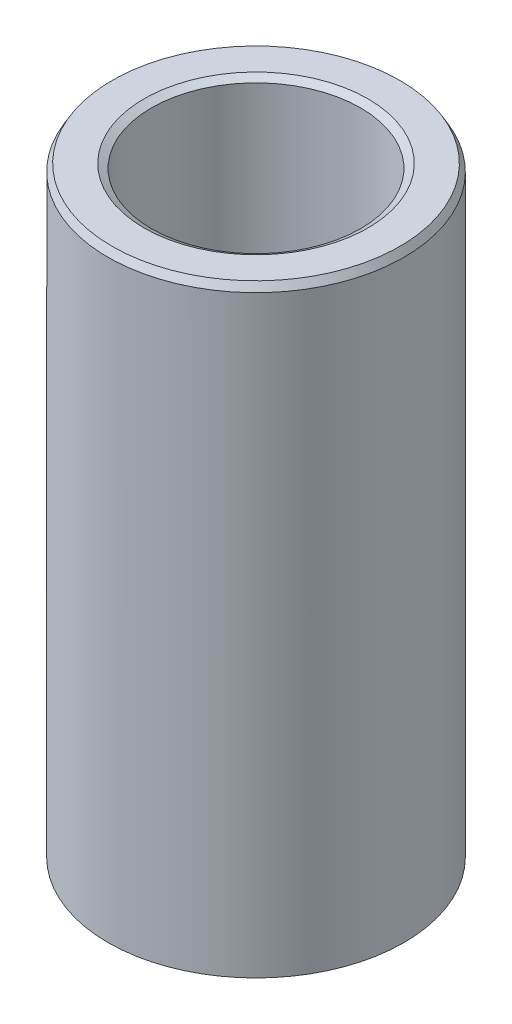
ISO-10303-21;
HEADER;
FILE_DESCRIPTION(('STEP AP214'),'2;1');
FILE_NAME('part.step','',(''),(''),'','','');
FILE_SCHEMA(('AUTOMOTIVE_DESIGN { 1 0 10303 214 1 1 1 1 }'));
ENDSEC;
DATA;
#1=APPLICATION_CONTEXT('core data for automotive mechanical design processes');
#2=APPLICATION_PROTOCOL_DEFINITION('international standard','automotive_design',2000,#1);
#3=PRODUCT_CONTEXT('',#1,'mechanical');
#4=PRODUCT('Part','Part','',(#3));
#5=PRODUCT_RELATED_PRODUCT_CATEGORY('part','',(#4));
#6=PRODUCT_DEFINITION_FORMATION('','',#4);
#7=PRODUCT_DEFINITION_CONTEXT('part definition',#1,'design');
#8=PRODUCT_DEFINITION('design','',#6,#7);
#9=PRODUCT_DEFINITION_SHAPE('','',#8);
#10=(LENGTH_UNIT() NAMED_UNIT(*) SI_UNIT(.MILLI.,.METRE.));
#11=(NAMED_UNIT(*) PLANE_ANGLE_UNIT() SI_UNIT($,.RADIAN.));
#12=(NAMED_UNIT(*) SI_UNIT($,.STERADIAN.) SOLID_ANGLE_UNIT());
#13=UNCERTAINTY_MEASURE_WITH_UNIT(LENGTH_MEASURE(1.E-05),#10,'distance_accuracy_value','');
#14=(GEOMETRIC_REPRESENTATION_CONTEXT(3) GLOBAL_UNCERTAINTY_ASSIGNED_CONTEXT((#13)) GLOBAL_UNIT_ASSIGNED_CONTEXT((#10,
#11,#12)) REPRESENTATION_CONTEXT('',''));
#15=CARTESIAN_POINT('',(0.,0.,0.));
#16=DIRECTION('',(0.,0.,1.));
#17=DIRECTION('',(1.,0.,0.));
#18=AXIS2_PLACEMENT_3D('',#15,#16,#17);
#19=CARTESIAN_POINT('',(0.,235.009031367991,0.));
#20=DIRECTION('',(0.,-1.,0.));
#21=DIRECTION('',(0.,0.,-1.));
#22=AXIS2_PLACEMENT_3D('',#19,#20,#21);
#23=CYLINDRICAL_SURFACE('',#22,57.5);
#24=CARTESIAN_POINT('',(0.,1.63872268421589,0.));
#25=DIRECTION('',(0.,1.,0.));
#26=DIRECTION('',(0.,0.,1.));
#27=AXIS2_PLACEMENT_3D('',#24,#25,#26);
#28=CIRCLE('',#27,57.5);
#29=CARTESIAN_POINT('',(0.,1.63872268421586,-57.5));
#30=VERTEX_POINT('',#29);
#31=EDGE_CURVE('E10',#30,#30,#28,.T.);
#32=CARTESIAN_POINT('',(0.,232.170680419414,0.));
#33=DIRECTION('',(0.,1.,0.));
#34=DIRECTION('',(0.,0.,1.));
#35=AXIS2_PLACEMENT_3D('',#32,#33,#34);
#36=CIRCLE('',#35,57.5);
#37=CARTESIAN_POINT('',(0.,232.170680419414,-57.5));
#38=VERTEX_POINT('',#37);
#39=EDGE_CURVE('E50',#38,#38,#36,.F.);
#40=CARTESIAN_POINT('',(0.,1.63872268421586,-57.5));
#41=CARTESIAN_POINT('',(0.,4.04009724395751,-57.5));
#42=CARTESIAN_POINT('',(0.,6.44147180369915,-57.5));
#43=CARTESIAN_POINT('',(0.,11.2442209231824,-57.5));
#44=CARTESIAN_POINT('',(0.,13.6455954829241,-57.5));
#45=CARTESIAN_POINT('',(0.,18.4483446024074,-57.5));
#46=CARTESIAN_POINT('',(0.,20.849719162149,-57.5));
#47=CARTESIAN_POINT('',(0.,25.6524682816323,-57.5));
#48=CARTESIAN_POINT('',(0.,28.053842841374,-57.5));
#49=CARTESIAN_POINT('',(0.,32.8565919608573,-57.5));
#50=CARTESIAN_POINT('',(0.,35.2579665205989,-57.5));
#51=CARTESIAN_POINT('',(0.,40.0607156400822,-57.5));
#52=CARTESIAN_POINT('',(0.,42.4620901998238,-57.5));
#53=CARTESIAN_POINT('',(0.,47.2648393193071,-57.5));
#54=CARTESIAN_POINT('',(0.,49.6662138790488,-57.5));
#55=CARTESIAN_POINT('',(0.,54.4689629985321,-57.5));
#56=CARTESIAN_POINT('',(0.,56.8703375582737,-57.5));
#57=CARTESIAN_POINT('',(0.,61.673086677757,-57.5));
#58=CARTESIAN_POINT('',(0.,64.0744612374987,-57.5));
#59=CARTESIAN_POINT('',(0.,68.8772103569819,-57.5));
#60=CARTESIAN_POINT('',(0.,71.2785849167236,-57.5));
#61=CARTESIAN_POINT('',(0.,76.0813340362069,-57.5));
#62=CARTESIAN_POINT('',(0.,78.4827085959486,-57.5));
#63=CARTESIAN_POINT('',(0.,83.2854577154318,-57.5));
#64=CARTESIAN_POINT('',(0.,85.6868322751735,-57.5));
#65=CARTESIAN_POINT('',(0.,90.4895813946568,-57.5));
#66=CARTESIAN_POINT('',(0.,92.8909559543984,-57.5));
#67=CARTESIAN_POINT('',(0.,97.6937050738817,-57.5));
#68=CARTESIAN_POINT('',(0.,100.095079633623,-57.5));
#69=CARTESIAN_POINT('',(0.,104.897828753107,-57.5));
#70=CARTESIAN_POINT('',(0.,107.299203312848,-57.5));
#71=CARTESIAN_POINT('',(0.,112.101952432332,-57.5));
#72=CARTESIAN_POINT('',(0.,114.503326992073,-57.5));
#73=CARTESIAN_POINT('',(0.,119.306076111557,-57.5));
#74=CARTESIAN_POINT('',(0.,121.707450671298,-57.5));
#75=CARTESIAN_POINT('',(0.,126.510199790781,-57.5));
#76=CARTESIAN_POINT('',(0.,128.911574350523,-57.5));
#77=CARTESIAN_POINT('',(0.,133.714323470006,-57.5));
#78=CARTESIAN_POINT('',(0.,136.115698029748,-57.5));
#79=CARTESIAN_POINT('',(0.,140.918447149231,-57.5));
#80=CARTESIAN_POINT('',(0.,143.319821708973,-57.5));
#81=CARTESIAN_POINT('',(0.,148.122570828456,-57.5));
#82=CARTESIAN_POINT('',(0.,150.523945388198,-57.5));
#83=CARTESIAN_POINT('',(0.,155.326694507681,-57.5));
#84=CARTESIAN_POINT('',(0.,157.728069067423,-57.5));
#85=CARTESIAN_POINT('',(0.,162.530818186906,-57.5));
#86=CARTESIAN_POINT('',(0.,164.932192746648,-57.5));
#87=CARTESIAN_POINT('',(0.,169.734941866131,-57.5));
#88=CARTESIAN_POINT('',(0.,172.136316425873,-57.5));
#89=CARTESIAN_POINT('',(0.,176.939065545356,-57.5));
#90=CARTESIAN_POINT('',(0.,179.340440105098,-57.5));
#91=CARTESIAN_POINT('',(0.,184.143189224581,-57.5));
#92=CARTESIAN_POINT('',(0.,186.544563784323,-57.5));
#93=CARTESIAN_POINT('',(0.,191.347312903806,-57.5));
#94=CARTESIAN_POINT('',(0.,193.748687463548,-57.5));
#95=CARTESIAN_POINT('',(0.,198.551436583031,-57.5));
#96=CARTESIAN_POINT('',(0.,200.952811142772,-57.5));
#97=CARTESIAN_POINT('',(0.,205.755560262256,-57.5));
#98=CARTESIAN_POINT('',(0.,208.156934821997,-57.5));
#99=CARTESIAN_POINT('',(0.,212.959683941481,-57.5));
#100=CARTESIAN_POINT('',(0.,215.361058501222,-57.5));
#101=CARTESIAN_POINT('',(0.,220.163807620706,-57.5));
#102=CARTESIAN_POINT('',(0.,222.565182180447,-57.5));
#103=CARTESIAN_POINT('',(0.,227.367931299931,-57.5));
#104=CARTESIAN_POINT('',(0.,229.769305859672,-57.5));
#105=CARTESIAN_POINT('',(0.,232.170680419414,-57.5));
#106=B_SPLINE_CURVE_WITH_KNOTS('',3,(#40,#41,#42,#43,#44,#45,#46,#47,#48,#49,#50,#51,#52,#53,
#54,#55,#56,#57,#58,#59,#60,#61,#62,#63,#64,#65,#66,#67,#68,#69,#70,#71,#72,#73,#74,#75,#76,#77,
#78,#79,#80,#81,#82,#83,#84,#85,#86,#87,#88,#89,#90,#91,#92,#93,#94,#95,#96,#97,#98,#99,#100,
#101,#102,#103,#104,#105),.UNSPECIFIED.,.F.,.F.,(4,2,2,2,2,2,2,2,2,2,2,2,2,2,2,2,2,2,2,2,2,2,2,
2,2,2,2,2,2,2,2,2,4),(0.,7.20412367922493,14.4082473584499,21.6123710376748,28.8164947168998,
36.0206183961247,43.2247420753496,50.4288657545746,57.6329894337995,64.8371131130245,
72.0412367922494,79.2453604714743,86.4494841506992,93.6536078299242,100.857731509149,
108.061855188374,115.265978867599,122.470102546824,129.674226226049,136.878349905274,
144.082473584499,151.286597263724,158.490720942949,165.694844622174,172.898968301398,
180.103091980623,187.307215659848,194.511339339073,201.715463018298,208.919586697523,
216.123710376748,223.327834055973,230.531957735198),.UNSPECIFIED.);
#107=EDGE_CURVE('BSEAM39',#30,#38,#106,.T.);
#108=ORIENTED_EDGE('',*,*,#31,.T.);
#109=ORIENTED_EDGE('',*,*,#39,.T.);
#110=ORIENTED_EDGE('',*,*,#107,.T.);
#111=ORIENTED_EDGE('',*,*,#107,.F.);
#112=EDGE_LOOP('',(#108,#110,#109,#111));
#113=FACE_BOUND('',#112,.T.);
#114=ADVANCED_FACE('F39',(#113),#23,.T.);
#115=CARTESIAN_POINT('',(0.,235.009031367991,0.));
#116=DIRECTION('',(0.,1.,0.));
#117=DIRECTION('',(0.,0.,1.));
#118=AXIS2_PLACEMENT_3D('',#115,#116,#117);
#119=PLANE('',#118);
#120=CARTESIAN_POINT('',(0.,235.009031367991,0.));
#121=DIRECTION('',(0.,1.,0.));
#122=DIRECTION('',(0.,0.,1.));
#123=AXIS2_PLACEMENT_3D('',#120,#121,#122);
#124=CIRCLE('',#123,43.4793904376041);
#125=CARTESIAN_POINT('',(0.,235.009031367991,43.4793904376041));
#126=VERTEX_POINT('',#125);
#127=EDGE_CURVE('E58',#126,#126,#124,.F.);
#128=ORIENTED_EDGE('',*,*,#127,.T.);
#129=EDGE_LOOP('',(#128));
#130=FACE_BOUND('',#129,.T.);
#131=CARTESIAN_POINT('',(0.,235.009031367991,0.));
#132=DIRECTION('',(0.,1.,0.));
#133=DIRECTION('',(0.,0.,1.));
#134=AXIS2_PLACEMENT_3D('',#131,#132,#133);
#135=CIRCLE('',#134,55.8612773157843);
#136=CARTESIAN_POINT('',(0.,235.009031367991,55.8612773157843));
#137=VERTEX_POINT('',#136);
#138=EDGE_CURVE('E61',#137,#137,#135,.T.);
#139=ORIENTED_EDGE('',*,*,#138,.T.);
#140=EDGE_LOOP('',(#139));
#141=FACE_BOUND('',#140,.T.);
#142=ADVANCED_FACE('F88',(#130,#141),#119,.T.);
#143=CARTESIAN_POINT('',(0.,0.,0.));
#144=DIRECTION('',(0.,1.,0.));
#145=DIRECTION('',(0.,0.,1.));
#146=AXIS2_PLACEMENT_3D('',#143,#144,#145);
#147=PLANE('',#146);
#148=CARTESIAN_POINT('',(0.,0.,0.));
#149=DIRECTION('',(0.,1.,0.));
#150=DIRECTION('',(0.,0.,1.));
#151=AXIS2_PLACEMENT_3D('',#148,#149,#150);
#152=CIRCLE('',#151,42.2797621732423);
#153=CARTESIAN_POINT('',(0.,0.,-42.2797621732423));
#154=VERTEX_POINT('',#153);
#155=EDGE_CURVE('E51',#154,#154,#152,.T.);
#156=ORIENTED_EDGE('',*,*,#155,.T.);
#157=EDGE_LOOP('',(#156));
#158=FACE_BOUND('',#157,.T.);
#159=CARTESIAN_POINT('',(0.,0.,0.));
#160=DIRECTION('',(0.,1.,0.));
#161=DIRECTION('',(0.,0.,1.));
#162=AXIS2_PLACEMENT_3D('',#159,#160,#161);
#163=CIRCLE('',#162,54.6616490514224);
#164=CARTESIAN_POINT('',(0.,0.,54.6616490514224));
#165=VERTEX_POINT('',#164);
#166=EDGE_CURVE('E54',#165,#165,#163,.F.);
#167=ORIENTED_EDGE('',*,*,#166,.T.);
#168=EDGE_LOOP('',(#167));
#169=FACE_BOUND('',#168,.T.);
#170=ADVANCED_FACE('F83',(#158,#169),#147,.F.);
#171=CARTESIAN_POINT('',(0.,235.009031367991,0.));
#172=DIRECTION('',(0.,-1.,0.));
#173=DIRECTION('',(0.,0.,-1.));
#174=AXIS2_PLACEMENT_3D('',#171,#172,#173);
#175=CYLINDRICAL_SURFACE('',#174,40.6410394890264);
#176=CARTESIAN_POINT('',(0.,233.370308683775,0.));
#177=DIRECTION('',(0.,1.,0.));
#178=DIRECTION('',(0.,0.,1.));
#179=AXIS2_PLACEMENT_3D('',#176,#177,#178);
#180=CIRCLE('',#179,40.6410394890264);
#181=CARTESIAN_POINT('',(0.,233.370308683775,-40.6410394890264));
#182=VERTEX_POINT('',#181);
#183=EDGE_CURVE('E67',#182,#182,#180,.T.);
#184=CARTESIAN_POINT('',(0.,2.83835094857754,0.));
#185=DIRECTION('',(0.,1.,0.));
#186=DIRECTION('',(0.,0.,1.));
#187=AXIS2_PLACEMENT_3D('',#184,#185,#186);
#188=CIRCLE('',#187,40.6410394890264);
#189=CARTESIAN_POINT('',(0.,2.83835094857751,-40.6410394890264));
#190=VERTEX_POINT('',#189);
#191=EDGE_CURVE('E69',#190,#190,#188,.F.);
#192=CARTESIAN_POINT('',(0.,233.370308683775,-40.6410394890264));
#193=CARTESIAN_POINT('',(0.,230.968934124033,-40.6410394890264));
#194=CARTESIAN_POINT('',(0.,228.567559564292,-40.6410394890264));
#195=CARTESIAN_POINT('',(0.,223.764810444809,-40.6410394890264));
#196=CARTESIAN_POINT('',(0.,221.363435885067,-40.6410394890264));
#197=CARTESIAN_POINT('',(0.,216.560686765584,-40.6410394890264));
#198=CARTESIAN_POINT('',(0.,214.159312205842,-40.6410394890264));
#199=CARTESIAN_POINT('',(0.,209.356563086359,-40.6410394890264));
#200=CARTESIAN_POINT('',(0.,206.955188526617,-40.6410394890264));
#201=CARTESIAN_POINT('',(0.,202.152439407134,-40.6410394890264));
#202=CARTESIAN_POINT('',(0.,199.751064847392,-40.6410394890264));
#203=CARTESIAN_POINT('',(0.,194.948315727909,-40.6410394890264));
#204=CARTESIAN_POINT('',(0.,192.546941168167,-40.6410394890264));
#205=CARTESIAN_POINT('',(0.,187.744192048684,-40.6410394890264));
#206=CARTESIAN_POINT('',(0.,185.342817488942,-40.6410394890264));
#207=CARTESIAN_POINT('',(0.,180.540068369459,-40.6410394890264));
#208=CARTESIAN_POINT('',(0.,178.138693809717,-40.6410394890264));
#209=CARTESIAN_POINT('',(0.,173.335944690234,-40.6410394890264));
#210=CARTESIAN_POINT('',(0.,170.934570130492,-40.6410394890264));
#211=CARTESIAN_POINT('',(0.,166.131821011009,-40.6410394890264));
#212=CARTESIAN_POINT('',(0.,163.730446451268,-40.6410394890264));
#213=CARTESIAN_POINT('',(0.,158.927697331784,-40.6410394890264));
#214=CARTESIAN_POINT('',(0.,156.526322772043,-40.6410394890264));
#215=CARTESIAN_POINT('',(0.,151.723573652559,-40.6410394890264));
#216=CARTESIAN_POINT('',(0.,149.322199092818,-40.6410394890264));
#217=CARTESIAN_POINT('',(0.,144.519449973334,-40.6410394890264));
#218=CARTESIAN_POINT('',(0.,142.118075413593,-40.6410394890264));
#219=CARTESIAN_POINT('',(0.,137.315326294109,-40.6410394890264));
#220=CARTESIAN_POINT('',(0.,134.913951734368,-40.6410394890264));
#221=CARTESIAN_POINT('',(0.,130.111202614885,-40.6410394890264));
#222=CARTESIAN_POINT('',(0.,127.709828055143,-40.6410394890264));
#223=CARTESIAN_POINT('',(0.,122.90707893566,-40.6410394890264));
#224=CARTESIAN_POINT('',(0.,120.505704375918,-40.6410394890264));
#225=CARTESIAN_POINT('',(0.,115.702955256435,-40.6410394890264));
#226=CARTESIAN_POINT('',(0.,113.301580696693,-40.6410394890264));
#227=CARTESIAN_POINT('',(0.,108.49883157721,-40.6410394890264));
#228=CARTESIAN_POINT('',(0.,106.097457017468,-40.6410394890264));
#229=CARTESIAN_POINT('',(0.,101.294707897985,-40.6410394890264));
#230=CARTESIAN_POINT('',(0.,98.8933333382432,-40.6410394890264));
#231=CARTESIAN_POINT('',(0.,94.0905842187599,-40.6410394890264));
#232=CARTESIAN_POINT('',(0.,91.6892096590183,-40.6410394890264));
#233=CARTESIAN_POINT('',(0.,86.886460539535,-40.6410394890264));
#234=CARTESIAN_POINT('',(0.,84.4850859797933,-40.6410394890264));
#235=CARTESIAN_POINT('',(0.,79.68233686031,-40.6410394890264));
#236=CARTESIAN_POINT('',(0.,77.2809623005684,-40.6410394890264));
#237=CARTESIAN_POINT('',(0.,72.4782131810851,-40.6410394890264));
#238=CARTESIAN_POINT('',(0.,70.0768386213435,-40.6410394890264));
#239=CARTESIAN_POINT('',(0.,65.2740895018602,-40.6410394890264));
#240=CARTESIAN_POINT('',(0.,62.8727149421186,-40.6410394890264));
#241=CARTESIAN_POINT('',(0.,58.0699658226353,-40.6410394890264));
#242=CARTESIAN_POINT('',(0.,55.6685912628936,-40.6410394890264));
#243=CARTESIAN_POINT('',(0.,50.8658421434103,-40.6410394890264));
#244=CARTESIAN_POINT('',(0.,48.4644675836687,-40.6410394890264));
#245=CARTESIAN_POINT('',(0.,43.6617184641854,-40.6410394890264));
#246=CARTESIAN_POINT('',(0.,41.2603439044438,-40.6410394890264));
#247=CARTESIAN_POINT('',(0.,36.4575947849605,-40.6410394890264));
#248=CARTESIAN_POINT('',(0.,34.0562202252189,-40.6410394890264));
#249=CARTESIAN_POINT('',(0.,29.2534711057356,-40.6410394890264));
#250=CARTESIAN_POINT('',(0.,26.8520965459939,-40.6410394890264));
#251=CARTESIAN_POINT('',(0.,22.0493474265106,-40.6410394890264));
#252=CARTESIAN_POINT('',(0.,19.647972866769,-40.6410394890264));
#253=CARTESIAN_POINT('',(0.,14.8452237472857,-40.6410394890264));
#254=CARTESIAN_POINT('',(0.,12.4438491875441,-40.6410394890264));
#255=CARTESIAN_POINT('',(0.,7.6411000680608,-40.6410394890264));
#256=CARTESIAN_POINT('',(0.,5.23972550831916,-40.6410394890264));
#257=CARTESIAN_POINT('',(0.,2.83835094857751,-40.6410394890264));
#258=B_SPLINE_CURVE_WITH_KNOTS('',3,(#192,#193,#194,#195,#196,#197,#198,#199,#200,#201,#202,
#203,#204,#205,#206,#207,#208,#209,#210,#211,#212,#213,#214,#215,#216,#217,#218,#219,#220,#221,
#222,#223,#224,#225,#226,#227,#228,#229,#230,#231,#232,#233,#234,#235,#236,#237,#238,#239,#240,
#241,#242,#243,#244,#245,#246,#247,#248,#249,#250,#251,#252,#253,#254,#255,#256,#257),
.UNSPECIFIED.,.F.,.F.,(4,2,2,2,2,2,2,2,2,2,2,2,2,2,2,2,2,2,2,2,2,2,2,2,2,2,2,2,2,2,2,2,4),(0.,
7.2041236792249,14.4082473584498,21.6123710376747,28.8164947168997,36.0206183961246,
43.2247420753495,50.4288657545744,57.6329894337994,64.8371131130243,72.0412367922492,
79.2453604714742,86.4494841506991,93.653607829924,100.857731509149,108.061855188374,
115.265978867599,122.470102546824,129.674226226049,136.878349905274,144.082473584498,
151.286597263723,158.490720942948,165.694844622173,172.898968301398,180.103091980623,
187.307215659848,194.511339339073,201.715463018298,208.919586697523,216.123710376748,
223.327834055973,230.531957735198),.UNSPECIFIED.);
#259=EDGE_CURVE('BSEAM71',#182,#190,#258,.T.);
#260=ORIENTED_EDGE('',*,*,#183,.T.);
#261=ORIENTED_EDGE('',*,*,#191,.T.);
#262=ORIENTED_EDGE('',*,*,#259,.T.);
#263=ORIENTED_EDGE('',*,*,#259,.F.);
#264=EDGE_LOOP('',(#260,#262,#261,#263));
#265=FACE_BOUND('',#264,.T.);
#266=ADVANCED_FACE('F71',(#265),#175,.F.);
#267=CARTESIAN_POINT('',(0.,233.370308683775,0.));
#268=DIRECTION('',(0.,1.,0.));
#269=DIRECTION('',(0.,0.,1.));
#270=AXIS2_PLACEMENT_3D('',#267,#268,#269);
#271=CONICAL_SURFACE('',#270,40.6410394890264,1.0471975511966);
#272=ORIENTED_EDGE('',*,*,#127,.F.);
#273=EDGE_LOOP('',(#272));
#274=FACE_BOUND('',#273,.T.);
#275=ORIENTED_EDGE('',*,*,#183,.F.);
#276=EDGE_LOOP('',(#275));
#277=FACE_BOUND('',#276,.T.);
#278=ADVANCED_FACE('F77',(#274,#277),#271,.F.);
#279=CARTESIAN_POINT('',(0.,0.,0.));
#280=DIRECTION('',(0.,-1.,0.));
#281=DIRECTION('',(0.,0.,-1.));
#282=AXIS2_PLACEMENT_3D('',#279,#280,#281);
#283=CONICAL_SURFACE('',#282,42.2797621732423,0.52359877559829);
#284=CARTESIAN_POINT('',(0.,2.83835094857754,-40.6410394890264));
#285=CARTESIAN_POINT('',(0.,2.80878479286319,-40.658109516987));
#286=CARTESIAN_POINT('',(0.,2.77921863714884,-40.6751795449476));
#287=CARTESIAN_POINT('',(0.,2.72008632572014,-40.7093196008688));
#288=CARTESIAN_POINT('',(0.,2.69052017000579,-40.7263896288293));
#289=CARTESIAN_POINT('',(0.,2.63138785857709,-40.7605296847505));
#290=CARTESIAN_POINT('',(0.,2.60182170286274,-40.7775997127111));
#291=CARTESIAN_POINT('',(0.,2.54268939143405,-40.8117397686323));
#292=CARTESIAN_POINT('',(0.,2.5131232357197,-40.8288097965928));
#293=CARTESIAN_POINT('',(0.,2.453990924291,-40.862949852514));
#294=CARTESIAN_POINT('',(0.,2.42442476857665,-40.8800198804746));
#295=CARTESIAN_POINT('',(0.,2.36529245714795,-40.9141599363957));
#296=CARTESIAN_POINT('',(0.,2.3357263014336,-40.9312299643563));
#297=CARTESIAN_POINT('',(0.,2.2765939900049,-40.9653700202775));
#298=CARTESIAN_POINT('',(0.,2.24702783429055,-40.9824400482381));
#299=CARTESIAN_POINT('',(0.,2.18789552286185,-41.0165801041592));
#300=CARTESIAN_POINT('',(0.,2.1583293671475,-41.0336501321198));
#301=CARTESIAN_POINT('',(0.,2.0991970557188,-41.067790188041));
#302=CARTESIAN_POINT('',(0.,2.06963090000446,-41.0848602160016));
#303=CARTESIAN_POINT('',(0.,2.01049858857576,-41.1190002719227));
#304=CARTESIAN_POINT('',(0.,1.98093243286141,-41.1360702998833));
#305=CARTESIAN_POINT('',(0.,1.92180012143271,-41.1702103558045));
#306=CARTESIAN_POINT('',(0.,1.89223396571836,-41.187280383765));
#307=CARTESIAN_POINT('',(0.,1.83310165428966,-41.2214204396862));
#308=CARTESIAN_POINT('',(0.,1.80353549857531,-41.2384904676468));
#309=CARTESIAN_POINT('',(0.,1.74440318714661,-41.2726305235679));
#310=CARTESIAN_POINT('',(0.,1.71483703143226,-41.2897005515285));
#311=CARTESIAN_POINT('',(0.,1.65570472000356,-41.3238406074497));
#312=CARTESIAN_POINT('',(0.,1.62613856428922,-41.3409106354103));
#313=CARTESIAN_POINT('',(0.,1.56700625286052,-41.3750506913314));
#314=CARTESIAN_POINT('',(0.,1.53744009714617,-41.392120719292));
#315=CARTESIAN_POINT('',(0.,1.47830778571747,-41.4262607752132));
#316=CARTESIAN_POINT('',(0.,1.44874163000312,-41.4433308031738));
#317=CARTESIAN_POINT('',(0.,1.38960931857442,-41.4774708590949));
#318=CARTESIAN_POINT('',(0.,1.36004316286007,-41.4945408870555));
#319=CARTESIAN_POINT('',(0.,1.30091085143137,-41.5286809429767));
#320=CARTESIAN_POINT('',(0.,1.27134469571702,-41.5457509709373));
#321=CARTESIAN_POINT('',(0.,1.21221238428832,-41.5798910268584));
#322=CARTESIAN_POINT('',(0.,1.18264622857397,-41.596961054819));
#323=CARTESIAN_POINT('',(0.,1.12351391714528,-41.6311011107402));
#324=CARTESIAN_POINT('',(0.,1.09394776143093,-41.6481711387008));
#325=CARTESIAN_POINT('',(0.,1.03481545000223,-41.6823111946219));
#326=CARTESIAN_POINT('',(0.,1.00524929428788,-41.6993812225825));
#327=CARTESIAN_POINT('',(0.,0.94611698285918,-41.7335212785037));
#328=CARTESIAN_POINT('',(0.,0.91655082714483,-41.7505913064642));
#329=CARTESIAN_POINT('',(0.,0.857418515716132,-41.7847313623854));
#330=CARTESIAN_POINT('',(0.,0.827852360001782,-41.801801390346));
#331=CARTESIAN_POINT('',(0.,0.768720048573084,-41.8359414462671));
#332=CARTESIAN_POINT('',(0.,0.739153892858734,-41.8530114742277));
#333=CARTESIAN_POINT('',(0.,0.680021581430035,-41.8871515301489));
#334=CARTESIAN_POINT('',(0.,0.650455425715686,-41.9042215581095));
#335=CARTESIAN_POINT('',(0.,0.591323114286987,-41.9383616140306));
#336=CARTESIAN_POINT('',(0.,0.561756958572638,-41.9554316419912));
#337=CARTESIAN_POINT('',(0.,0.502624647143939,-41.9895716979124));
#338=CARTESIAN_POINT('',(0.,0.47305849142959,-42.006641725873));
#339=CARTESIAN_POINT('',(0.,0.413926180000891,-42.0407817817941));
#340=CARTESIAN_POINT('',(0.,0.384360024286542,-42.0578518097547));
#341=CARTESIAN_POINT('',(0.,0.325227712857843,-42.0919918656759));
#342=CARTESIAN_POINT('',(0.,0.295661557143494,-42.1090618936365));
#343=CARTESIAN_POINT('',(0.,0.236529245714795,-42.1432019495576));
#344=CARTESIAN_POINT('',(0.,0.206963090000446,-42.1602719775182));
#345=CARTESIAN_POINT('',(0.,0.147830778571747,-42.1944120334394));
#346=CARTESIAN_POINT('',(0.,0.118264622857397,-42.2114820613999));
#347=CARTESIAN_POINT('',(0.,0.0591323114286987,-42.2456221173211));
#348=CARTESIAN_POINT('',(0.,0.0295661557143494,-42.2626921452817));
#349=CARTESIAN_POINT('',(0.,0.,-42.2797621732423));
#350=B_SPLINE_CURVE_WITH_KNOTS('',3,(#284,#285,#286,#287,#288,#289,#290,#291,#292,#293,#294,
#295,#296,#297,#298,#299,#300,#301,#302,#303,#304,#305,#306,#307,#308,#309,#310,#311,#312,#313,
#314,#315,#316,#317,#318,#319,#320,#321,#322,#323,#324,#325,#326,#327,#328,#329,#330,#331,#332,
#333,#334,#335,#336,#337,#338,#339,#340,#341,#342,#343,#344,#345,#346,#347,#348,#349),
.UNSPECIFIED.,.F.,.F.,(4,2,2,2,2,2,2,2,2,2,2,2,2,2,2,2,2,2,2,2,2,2,2,2,2,2,2,2,2,2,2,2,4),(0.,
0.102420167763491,0.204840335526983,0.307260503290474,0.409680671053965,0.512100838817457,
0.614521006580948,0.716941174344439,0.819361342107931,0.921781509871422,1.02420167763491,
1.1266218453984,1.2290420131619,1.33146218092539,1.43388234868888,1.53630251645237,
1.63872268421587,1.74114285197936,1.84356301974285,1.94598318750634,2.04840335526983,
2.15082352303332,2.25324369079681,2.3556638585603,2.4580840263238,2.56050419408729,
2.66292436185078,2.76534452961427,2.86776469737776,2.97018486514125,3.07260503290474,
3.17502520066823,3.27744536843173),.UNSPECIFIED.);
#351=EDGE_CURVE('BSEAM73',#190,#154,#350,.T.);
#352=ORIENTED_EDGE('',*,*,#191,.F.);
#353=ORIENTED_EDGE('',*,*,#155,.F.);
#354=ORIENTED_EDGE('',*,*,#351,.T.);
#355=ORIENTED_EDGE('',*,*,#351,.F.);
#356=EDGE_LOOP('',(#352,#354,#353,#355));
#357=FACE_BOUND('',#356,.T.);
#358=ADVANCED_FACE('F73',(#357),#283,.F.);
#359=CARTESIAN_POINT('',(0.,1.63872268421589,0.));
#360=DIRECTION('',(0.,1.,0.));
#361=DIRECTION('',(0.,0.,1.));
#362=AXIS2_PLACEMENT_3D('',#359,#360,#361);
#363=CONICAL_SURFACE('',#362,57.5,1.04719755119661);
#364=ORIENTED_EDGE('',*,*,#166,.F.);
#365=EDGE_LOOP('',(#364));
#366=FACE_BOUND('',#365,.T.);
#367=ORIENTED_EDGE('',*,*,#31,.F.);
#368=EDGE_LOOP('',(#367));
#369=FACE_BOUND('',#368,.T.);
#370=ADVANCED_FACE('F76',(#366,#369),#363,.T.);
#371=CARTESIAN_POINT('',(0.,235.009031367991,0.));
#372=DIRECTION('',(0.,-1.,0.));
#373=DIRECTION('',(0.,0.,-1.));
#374=AXIS2_PLACEMENT_3D('',#371,#372,#373);
#375=CONICAL_SURFACE('',#374,55.8612773157843,0.5235987755983);
#376=ORIENTED_EDGE('',*,*,#39,.F.);
#377=EDGE_LOOP('',(#376));
#378=FACE_BOUND('',#377,.T.);
#379=ORIENTED_EDGE('',*,*,#138,.F.);
#380=EDGE_LOOP('',(#379));
#381=FACE_BOUND('',#380,.T.);
#382=ADVANCED_FACE('F45',(#378,#381),#375,.T.);
#383=CLOSED_SHELL('',(#114,#142,#170,#266,#278,#358,#370,#382));
#384=MANIFOLD_SOLID_BREP('B2',#383);
#385=ADVANCED_BREP_SHAPE_REPRESENTATION('',(#18,#384),#14);
#386=SHAPE_DEFINITION_REPRESENTATION(#9,#385);
ENDSEC;
END-ISO-10303-21;
